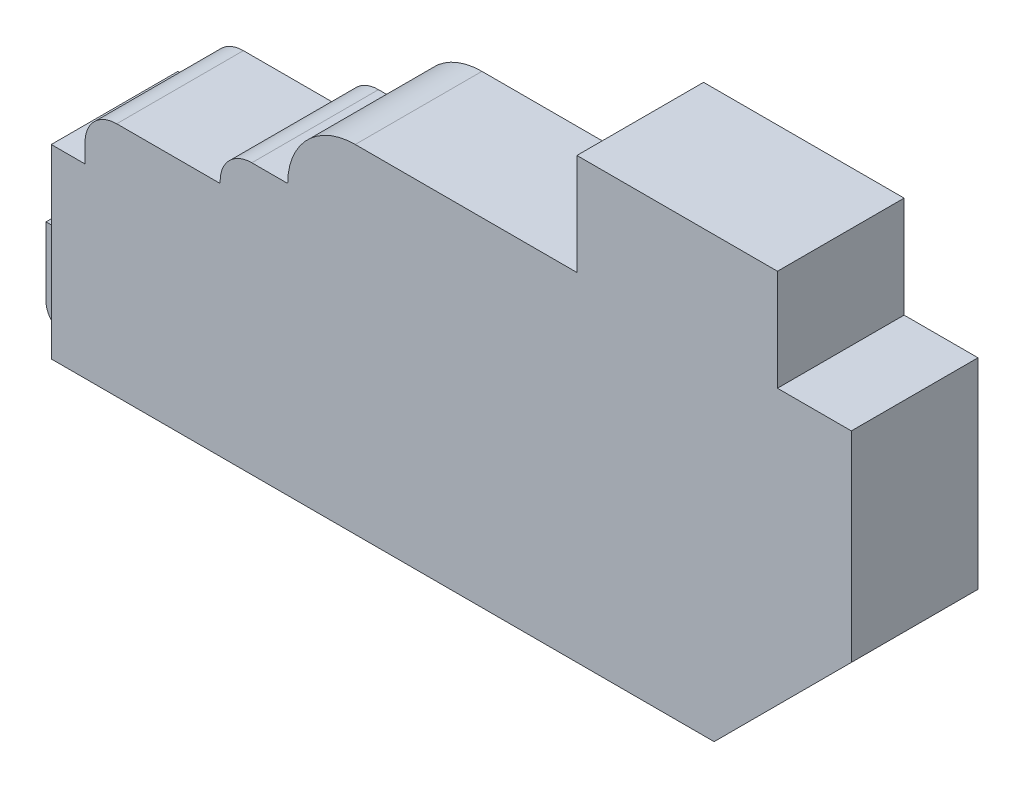
ISO-10303-21;
HEADER;
FILE_DESCRIPTION(('STEP AP214'),'2;1');
FILE_NAME('part.step','',(''),(''),'','','');
FILE_SCHEMA(('AUTOMOTIVE_DESIGN { 1 0 10303 214 1 1 1 1 }'));
ENDSEC;
DATA;
#1=APPLICATION_CONTEXT('core data for automotive mechanical design processes');
#2=APPLICATION_PROTOCOL_DEFINITION('international standard','automotive_design',2000,#1);
#3=PRODUCT_CONTEXT('',#1,'mechanical');
#4=PRODUCT('Part','Part','',(#3));
#5=PRODUCT_RELATED_PRODUCT_CATEGORY('part','',(#4));
#6=PRODUCT_DEFINITION_FORMATION('','',#4);
#7=PRODUCT_DEFINITION_CONTEXT('part definition',#1,'design');
#8=PRODUCT_DEFINITION('design','',#6,#7);
#9=PRODUCT_DEFINITION_SHAPE('','',#8);
#10=(LENGTH_UNIT() NAMED_UNIT(*) SI_UNIT(.MILLI.,.METRE.));
#11=(NAMED_UNIT(*) PLANE_ANGLE_UNIT() SI_UNIT($,.RADIAN.));
#12=(NAMED_UNIT(*) SI_UNIT($,.STERADIAN.) SOLID_ANGLE_UNIT());
#13=UNCERTAINTY_MEASURE_WITH_UNIT(LENGTH_MEASURE(1.E-05),#10,'distance_accuracy_value','');
#14=(GEOMETRIC_REPRESENTATION_CONTEXT(3) GLOBAL_UNCERTAINTY_ASSIGNED_CONTEXT((#13)) GLOBAL_UNIT_ASSIGNED_CONTEXT((#10,
#11,#12)) REPRESENTATION_CONTEXT('',''));
#15=CARTESIAN_POINT('',(0.,0.,0.));
#16=DIRECTION('',(0.,0.,1.));
#17=DIRECTION('',(1.,0.,0.));
#18=AXIS2_PLACEMENT_3D('',#15,#16,#17);
#19=CARTESIAN_POINT('',(-4.7625,13.49375,9.525));
#20=DIRECTION('',(0.,-1.,0.));
#21=DIRECTION('',(0.,0.,-1.));
#22=AXIS2_PLACEMENT_3D('',#19,#20,#21);
#23=PLANE('',#22);
#24=DIRECTION('',(0.,0.,-1.));
#25=VECTOR('',#24,1.);
#26=CARTESIAN_POINT('',(-4.7625,13.49375,9.525));
#27=LINE('',#26,#25);
#28=CARTESIAN_POINT('',(-4.7625,13.49375,5.55625));
#29=VERTEX_POINT('',#28);
#30=CARTESIAN_POINT('',(-4.7625,13.49375,-5.55625));
#31=VERTEX_POINT('',#30);
#32=EDGE_CURVE('E11',#29,#31,#27,.T.);
#33=ORIENTED_EDGE('',*,*,#32,.F.);
#34=DIRECTION('',(1.,0.,0.));
#35=VECTOR('',#34,1.);
#36=CARTESIAN_POINT('',(-4.7625,13.49375,5.55625));
#37=LINE('',#36,#35);
#38=CARTESIAN_POINT('',(0.,13.49375,5.55625));
#39=VERTEX_POINT('',#38);
#40=EDGE_CURVE('E533',#29,#39,#37,.T.);
#41=ORIENTED_EDGE('',*,*,#40,.T.);
#42=DIRECTION('',(0.,0.,-1.));
#43=VECTOR('',#42,1.);
#44=CARTESIAN_POINT('',(0.,13.49375,9.525));
#45=LINE('',#44,#43);
#46=CARTESIAN_POINT('',(0.,13.49375,-5.55625));
#47=VERTEX_POINT('',#46);
#48=EDGE_CURVE('E513',#39,#47,#45,.T.);
#49=ORIENTED_EDGE('',*,*,#48,.T.);
#50=DIRECTION('',(-1.,0.,0.));
#51=VECTOR('',#50,1.);
#52=CARTESIAN_POINT('',(-4.7625,13.49375,-5.55625));
#53=LINE('',#52,#51);
#54=EDGE_CURVE('E549',#47,#31,#53,.T.);
#55=ORIENTED_EDGE('',*,*,#54,.T.);
#56=EDGE_LOOP('',(#33,#41,#49,#55));
#57=FACE_BOUND('',#56,.T.);
#58=ADVANCED_FACE('F360',(#57),#23,.F.);
#59=CARTESIAN_POINT('',(-4.7625,3.17500000000002,9.525));
#60=DIRECTION('',(1.,0.,0.));
#61=DIRECTION('',(0.,0.,-1.));
#62=AXIS2_PLACEMENT_3D('',#59,#60,#61);
#63=PLANE('',#62);
#64=DIRECTION('',(0.,0.,-1.));
#65=VECTOR('',#64,1.);
#66=CARTESIAN_POINT('',(-4.7625,3.17500000000002,9.525));
#67=LINE('',#66,#65);
#68=CARTESIAN_POINT('',(-4.7625,3.175,5.55625));
#69=VERTEX_POINT('',#68);
#70=CARTESIAN_POINT('',(-4.7625,3.175,-5.55625));
#71=VERTEX_POINT('',#70);
#72=EDGE_CURVE('E367',#69,#71,#67,.T.);
#73=ORIENTED_EDGE('',*,*,#72,.F.);
#74=DIRECTION('',(0.,-1.,0.));
#75=VECTOR('',#74,1.);
#76=CARTESIAN_POINT('',(-4.7625,16.03375,5.55625));
#77=LINE('',#76,#75);
#78=EDGE_CURVE('E528',#29,#69,#77,.T.);
#79=ORIENTED_EDGE('',*,*,#78,.F.);
#80=ORIENTED_EDGE('',*,*,#32,.T.);
#81=DIRECTION('',(0.,1.,0.));
#82=VECTOR('',#81,1.);
#83=CARTESIAN_POINT('',(-4.7625,16.03375,-5.55625));
#84=LINE('',#83,#82);
#85=EDGE_CURVE('E535',#71,#31,#84,.T.);
#86=ORIENTED_EDGE('',*,*,#85,.F.);
#87=EDGE_LOOP('',(#73,#79,#80,#86));
#88=FACE_BOUND('',#87,.T.);
#89=ADVANCED_FACE('F684',(#88),#63,.F.);
#90=CARTESIAN_POINT('',(-1.5875,3.175,9.525));
#91=DIRECTION('',(0.,0.,-1.));
#92=DIRECTION('',(-1.,0.,0.));
#93=AXIS2_PLACEMENT_3D('',#90,#91,#92);
#94=CYLINDRICAL_SURFACE('',#93,3.175);
#95=DIRECTION('',(0.,0.,-1.));
#96=VECTOR('',#95,1.);
#97=CARTESIAN_POINT('',(-1.58749999999998,0.,9.525));
#98=LINE('',#97,#96);
#99=CARTESIAN_POINT('',(-1.58749999999998,0.,5.55625));
#100=VERTEX_POINT('',#99);
#101=CARTESIAN_POINT('',(-1.58749999999998,0.,-5.55625));
#102=VERTEX_POINT('',#101);
#103=EDGE_CURVE('E672',#100,#102,#98,.T.);
#104=ORIENTED_EDGE('',*,*,#103,.F.);
#105=CARTESIAN_POINT('',(-1.5875,3.175,5.55625));
#106=DIRECTION('',(0.,0.,-1.));
#107=DIRECTION('',(-1.,0.,0.));
#108=AXIS2_PLACEMENT_3D('',#105,#106,#107);
#109=CIRCLE('',#108,3.175);
#110=EDGE_CURVE('E521',#100,#69,#109,.T.);
#111=ORIENTED_EDGE('',*,*,#110,.T.);
#112=ORIENTED_EDGE('',*,*,#72,.T.);
#113=CARTESIAN_POINT('',(-1.5875,3.175,-5.55625));
#114=DIRECTION('',(0.,0.,1.));
#115=DIRECTION('',(1.,0.,0.));
#116=AXIS2_PLACEMENT_3D('',#113,#114,#115);
#117=CIRCLE('',#116,3.175);
#118=EDGE_CURVE('E546',#71,#102,#117,.T.);
#119=ORIENTED_EDGE('',*,*,#118,.T.);
#120=EDGE_LOOP('',(#104,#111,#112,#119));
#121=FACE_BOUND('',#120,.T.);
#122=ADVANCED_FACE('F676',(#121),#94,.T.);
#123=CARTESIAN_POINT('',(-1.58749999999998,0.,9.525));
#124=DIRECTION('',(0.,1.,0.));
#125=DIRECTION('',(-1.,0.,0.));
#126=AXIS2_PLACEMENT_3D('',#123,#124,#125);
#127=PLANE('',#126);
#128=DIRECTION('',(1.,0.,0.));
#129=VECTOR('',#128,1.);
#130=CARTESIAN_POINT('',(-1.58749999999998,0.,9.525));
#131=LINE('',#130,#129);
#132=CARTESIAN_POINT('',(0.,0.,9.525));
#133=VERTEX_POINT('',#132);
#134=CARTESIAN_POINT('',(99.6949999999999,0.,9.525));
#135=VERTEX_POINT('',#134);
#136=EDGE_CURVE('E527',#133,#135,#131,.T.);
#137=ORIENTED_EDGE('',*,*,#136,.F.);
#138=DIRECTION('',(0.,0.,1.));
#139=VECTOR('',#138,1.);
#140=CARTESIAN_POINT('',(0.,0.,5.55625));
#141=LINE('',#140,#139);
#142=CARTESIAN_POINT('',(0.,0.,5.55625));
#143=VERTEX_POINT('',#142);
#144=EDGE_CURVE('E510',#143,#133,#141,.T.);
#145=ORIENTED_EDGE('',*,*,#144,.F.);
#146=DIRECTION('',(-1.,0.,0.));
#147=VECTOR('',#146,1.);
#148=CARTESIAN_POINT('',(20.3924246428055,0.,5.55625));
#149=LINE('',#148,#147);
#150=EDGE_CURVE('E516',#143,#100,#149,.T.);
#151=ORIENTED_EDGE('',*,*,#150,.T.);
#152=ORIENTED_EDGE('',*,*,#103,.T.);
#153=DIRECTION('',(-1.,0.,0.));
#154=VECTOR('',#153,1.);
#155=CARTESIAN_POINT('',(20.3924246428055,0.,-5.55625));
#156=LINE('',#155,#154);
#157=CARTESIAN_POINT('',(0.,0.,-5.55625));
#158=VERTEX_POINT('',#157);
#159=EDGE_CURVE('E543',#158,#102,#156,.T.);
#160=ORIENTED_EDGE('',*,*,#159,.F.);
#161=DIRECTION('',(0.,0.,1.));
#162=VECTOR('',#161,1.);
#163=CARTESIAN_POINT('',(0.,0.,-5.55625));
#164=LINE('',#163,#162);
#165=CARTESIAN_POINT('',(0.,0.,-9.525));
#166=VERTEX_POINT('',#165);
#167=EDGE_CURVE('E540',#166,#158,#164,.T.);
#168=ORIENTED_EDGE('',*,*,#167,.F.);
#169=DIRECTION('',(1.,0.,0.));
#170=VECTOR('',#169,1.);
#171=CARTESIAN_POINT('',(-1.58749999999998,0.,-9.525));
#172=LINE('',#171,#170);
#173=CARTESIAN_POINT('',(99.6949999999999,0.,-9.525));
#174=VERTEX_POINT('',#173);
#175=EDGE_CURVE('E558',#166,#174,#172,.T.);
#176=ORIENTED_EDGE('',*,*,#175,.T.);
#177=DIRECTION('',(0.,0.,-1.));
#178=VECTOR('',#177,1.);
#179=CARTESIAN_POINT('',(99.6949999999999,0.,9.525));
#180=LINE('',#179,#178);
#181=EDGE_CURVE('E669',#135,#174,#180,.T.);
#182=ORIENTED_EDGE('',*,*,#181,.F.);
#183=EDGE_LOOP('',(#137,#145,#151,#152,#160,#168,#176,#182));
#184=FACE_BOUND('',#183,.T.);
#185=ADVANCED_FACE('F525',(#184),#127,.F.);
#186=CARTESIAN_POINT('',(120.3325,20.6375,9.525));
#187=DIRECTION('',(-0.707106781186546,0.707106781186549,0.));
#188=DIRECTION('',(-0.707106781186549,-0.707106781186546,0.));
#189=AXIS2_PLACEMENT_3D('',#186,#187,#188);
#190=PLANE('',#189);
#191=ORIENTED_EDGE('',*,*,#181,.T.);
#192=DIRECTION('',(0.707106781186549,0.707106781186546,0.));
#193=VECTOR('',#192,1.);
#194=CARTESIAN_POINT('',(120.3325,20.6375,-9.525));
#195=LINE('',#194,#193);
#196=CARTESIAN_POINT('',(120.3325,20.6375,-9.525));
#197=VERTEX_POINT('',#196);
#198=EDGE_CURVE('E560',#174,#197,#195,.T.);
#199=ORIENTED_EDGE('',*,*,#198,.T.);
#200=DIRECTION('',(0.,0.,-1.));
#201=VECTOR('',#200,1.);
#202=CARTESIAN_POINT('',(120.3325,20.6375,9.525));
#203=LINE('',#202,#201);
#204=CARTESIAN_POINT('',(120.3325,20.6375,9.525));
#205=VERTEX_POINT('',#204);
#206=EDGE_CURVE('E667',#205,#197,#203,.T.);
#207=ORIENTED_EDGE('',*,*,#206,.F.);
#208=DIRECTION('',(0.707106781186549,0.707106781186546,0.));
#209=VECTOR('',#208,1.);
#210=CARTESIAN_POINT('',(120.3325,20.6375,9.525));
#211=LINE('',#210,#209);
#212=EDGE_CURVE('E608',#135,#205,#211,.T.);
#213=ORIENTED_EDGE('',*,*,#212,.F.);
#214=EDGE_LOOP('',(#191,#199,#207,#213));
#215=FACE_BOUND('',#214,.T.);
#216=ADVANCED_FACE('F698',(#215),#190,.F.);
#217=CARTESIAN_POINT('',(120.3325,50.8,9.525));
#218=DIRECTION('',(-1.,0.,0.));
#219=DIRECTION('',(0.,0.,1.));
#220=AXIS2_PLACEMENT_3D('',#217,#218,#219);
#221=PLANE('',#220);
#222=ORIENTED_EDGE('',*,*,#206,.T.);
#223=DIRECTION('',(0.,1.,0.));
#224=VECTOR('',#223,1.);
#225=CARTESIAN_POINT('',(120.3325,50.8,-9.525));
#226=LINE('',#225,#224);
#227=CARTESIAN_POINT('',(120.3325,50.8,-9.525));
#228=VERTEX_POINT('',#227);
#229=EDGE_CURVE('E563',#197,#228,#226,.T.);
#230=ORIENTED_EDGE('',*,*,#229,.T.);
#231=DIRECTION('',(0.,0.,-1.));
#232=VECTOR('',#231,1.);
#233=CARTESIAN_POINT('',(120.3325,50.8,9.525));
#234=LINE('',#233,#232);
#235=CARTESIAN_POINT('',(120.3325,50.8,9.525));
#236=VERTEX_POINT('',#235);
#237=EDGE_CURVE('E665',#236,#228,#234,.T.);
#238=ORIENTED_EDGE('',*,*,#237,.F.);
#239=DIRECTION('',(0.,1.,0.));
#240=VECTOR('',#239,1.);
#241=CARTESIAN_POINT('',(120.3325,50.8,9.525));
#242=LINE('',#241,#240);
#243=EDGE_CURVE('E610',#205,#236,#242,.T.);
#244=ORIENTED_EDGE('',*,*,#243,.F.);
#245=EDGE_LOOP('',(#222,#230,#238,#244));
#246=FACE_BOUND('',#245,.T.);
#247=ADVANCED_FACE('F706',(#246),#221,.F.);
#248=CARTESIAN_POINT('',(109.22,50.8,9.525));
#249=DIRECTION('',(0.,-1.,0.));
#250=DIRECTION('',(0.,0.,-1.));
#251=AXIS2_PLACEMENT_3D('',#248,#249,#250);
#252=PLANE('',#251);
#253=ORIENTED_EDGE('',*,*,#237,.T.);
#254=DIRECTION('',(-1.,0.,0.));
#255=VECTOR('',#254,1.);
#256=CARTESIAN_POINT('',(109.22,50.8,-9.525));
#257=LINE('',#256,#255);
#258=CARTESIAN_POINT('',(109.22,50.8,-9.525));
#259=VERTEX_POINT('',#258);
#260=EDGE_CURVE('E566',#228,#259,#257,.T.);
#261=ORIENTED_EDGE('',*,*,#260,.T.);
#262=DIRECTION('',(0.,0.,-1.));
#263=VECTOR('',#262,1.);
#264=CARTESIAN_POINT('',(109.22,50.8,9.525));
#265=LINE('',#264,#263);
#266=CARTESIAN_POINT('',(109.22,50.8,9.525));
#267=VERTEX_POINT('',#266);
#268=EDGE_CURVE('E663',#267,#259,#265,.T.);
#269=ORIENTED_EDGE('',*,*,#268,.F.);
#270=DIRECTION('',(-1.,0.,0.));
#271=VECTOR('',#270,1.);
#272=CARTESIAN_POINT('',(109.22,50.8,9.525));
#273=LINE('',#272,#271);
#274=EDGE_CURVE('E612',#236,#267,#273,.T.);
#275=ORIENTED_EDGE('',*,*,#274,.F.);
#276=EDGE_LOOP('',(#253,#261,#269,#275));
#277=FACE_BOUND('',#276,.T.);
#278=ADVANCED_FACE('F708',(#277),#252,.F.);
#279=CARTESIAN_POINT('',(109.22,66.04,9.525));
#280=DIRECTION('',(-1.,0.,0.));
#281=DIRECTION('',(0.,0.,1.));
#282=AXIS2_PLACEMENT_3D('',#279,#280,#281);
#283=PLANE('',#282);
#284=ORIENTED_EDGE('',*,*,#268,.T.);
#285=DIRECTION('',(0.,1.,0.));
#286=VECTOR('',#285,1.);
#287=CARTESIAN_POINT('',(109.22,66.04,-9.525));
#288=LINE('',#287,#286);
#289=CARTESIAN_POINT('',(109.22,66.04,-9.525));
#290=VERTEX_POINT('',#289);
#291=EDGE_CURVE('E569',#259,#290,#288,.T.);
#292=ORIENTED_EDGE('',*,*,#291,.T.);
#293=DIRECTION('',(0.,0.,-1.));
#294=VECTOR('',#293,1.);
#295=CARTESIAN_POINT('',(109.22,66.04,9.525));
#296=LINE('',#295,#294);
#297=CARTESIAN_POINT('',(109.22,66.04,9.525));
#298=VERTEX_POINT('',#297);
#299=EDGE_CURVE('E661',#298,#290,#296,.T.);
#300=ORIENTED_EDGE('',*,*,#299,.F.);
#301=DIRECTION('',(0.,1.,0.));
#302=VECTOR('',#301,1.);
#303=CARTESIAN_POINT('',(109.22,66.04,9.525));
#304=LINE('',#303,#302);
#305=EDGE_CURVE('E614',#267,#298,#304,.T.);
#306=ORIENTED_EDGE('',*,*,#305,.F.);
#307=EDGE_LOOP('',(#284,#292,#300,#306));
#308=FACE_BOUND('',#307,.T.);
#309=ADVANCED_FACE('F713',(#308),#283,.F.);
#310=CARTESIAN_POINT('',(79.0575,66.04,9.525));
#311=DIRECTION('',(0.,-1.,0.));
#312=DIRECTION('',(0.,0.,-1.));
#313=AXIS2_PLACEMENT_3D('',#310,#311,#312);
#314=PLANE('',#313);
#315=ORIENTED_EDGE('',*,*,#299,.T.);
#316=DIRECTION('',(-1.,0.,0.));
#317=VECTOR('',#316,1.);
#318=CARTESIAN_POINT('',(79.0575,66.04,-9.525));
#319=LINE('',#318,#317);
#320=CARTESIAN_POINT('',(79.0575,66.04,-9.525));
#321=VERTEX_POINT('',#320);
#322=EDGE_CURVE('E572',#290,#321,#319,.T.);
#323=ORIENTED_EDGE('',*,*,#322,.T.);
#324=DIRECTION('',(0.,0.,-1.));
#325=VECTOR('',#324,1.);
#326=CARTESIAN_POINT('',(79.0575,66.04,9.525));
#327=LINE('',#326,#325);
#328=CARTESIAN_POINT('',(79.0575,66.04,9.525));
#329=VERTEX_POINT('',#328);
#330=EDGE_CURVE('E659',#329,#321,#327,.T.);
#331=ORIENTED_EDGE('',*,*,#330,.F.);
#332=DIRECTION('',(-1.,0.,0.));
#333=VECTOR('',#332,1.);
#334=CARTESIAN_POINT('',(79.0575,66.04,9.525));
#335=LINE('',#334,#333);
#336=EDGE_CURVE('E616',#298,#329,#335,.T.);
#337=ORIENTED_EDGE('',*,*,#336,.F.);
#338=EDGE_LOOP('',(#315,#323,#331,#337));
#339=FACE_BOUND('',#338,.T.);
#340=ADVANCED_FACE('F719',(#339),#314,.F.);
#341=CARTESIAN_POINT('',(79.0575,50.8,9.525));
#342=DIRECTION('',(1.,0.,0.));
#343=DIRECTION('',(0.,0.,-1.));
#344=AXIS2_PLACEMENT_3D('',#341,#342,#343);
#345=PLANE('',#344);
#346=ORIENTED_EDGE('',*,*,#330,.T.);
#347=DIRECTION('',(0.,-1.,0.));
#348=VECTOR('',#347,1.);
#349=CARTESIAN_POINT('',(79.0575,50.8,-9.525));
#350=LINE('',#349,#348);
#351=CARTESIAN_POINT('',(79.0575,50.8,-9.525));
#352=VERTEX_POINT('',#351);
#353=EDGE_CURVE('E575',#321,#352,#350,.T.);
#354=ORIENTED_EDGE('',*,*,#353,.T.);
#355=DIRECTION('',(0.,0.,-1.));
#356=VECTOR('',#355,1.);
#357=CARTESIAN_POINT('',(79.0575,50.8,9.525));
#358=LINE('',#357,#356);
#359=CARTESIAN_POINT('',(79.0575,50.8,9.525));
#360=VERTEX_POINT('',#359);
#361=EDGE_CURVE('E657',#360,#352,#358,.T.);
#362=ORIENTED_EDGE('',*,*,#361,.F.);
#363=DIRECTION('',(0.,-1.,0.));
#364=VECTOR('',#363,1.);
#365=CARTESIAN_POINT('',(79.0575,50.8,9.525));
#366=LINE('',#365,#364);
#367=EDGE_CURVE('E618',#329,#360,#366,.T.);
#368=ORIENTED_EDGE('',*,*,#367,.F.);
#369=EDGE_LOOP('',(#346,#354,#362,#368));
#370=FACE_BOUND('',#369,.T.);
#371=ADVANCED_FACE('F723',(#370),#345,.F.);
#372=CARTESIAN_POINT('',(45.72,50.8,9.525));
#373=DIRECTION('',(0.,-1.,0.));
#374=DIRECTION('',(0.,0.,-1.));
#375=AXIS2_PLACEMENT_3D('',#372,#373,#374);
#376=PLANE('',#375);
#377=ORIENTED_EDGE('',*,*,#361,.T.);
#378=DIRECTION('',(-1.,0.,0.));
#379=VECTOR('',#378,1.);
#380=CARTESIAN_POINT('',(45.72,50.8,-9.525));
#381=LINE('',#380,#379);
#382=CARTESIAN_POINT('',(45.72,50.8,-9.525));
#383=VERTEX_POINT('',#382);
#384=EDGE_CURVE('E578',#352,#383,#381,.T.);
#385=ORIENTED_EDGE('',*,*,#384,.T.);
#386=DIRECTION('',(0.,0.,-1.));
#387=VECTOR('',#386,1.);
#388=CARTESIAN_POINT('',(45.72,50.8,9.525));
#389=LINE('',#388,#387);
#390=CARTESIAN_POINT('',(45.72,50.8,9.525));
#391=VERTEX_POINT('',#390);
#392=EDGE_CURVE('E655',#391,#383,#389,.T.);
#393=ORIENTED_EDGE('',*,*,#392,.F.);
#394=DIRECTION('',(-1.,0.,0.));
#395=VECTOR('',#394,1.);
#396=CARTESIAN_POINT('',(45.72,50.8,9.525));
#397=LINE('',#396,#395);
#398=EDGE_CURVE('E620',#360,#391,#397,.T.);
#399=ORIENTED_EDGE('',*,*,#398,.F.);
#400=EDGE_LOOP('',(#377,#385,#393,#399));
#401=FACE_BOUND('',#400,.T.);
#402=ADVANCED_FACE('F728',(#401),#376,.F.);
#403=CARTESIAN_POINT('',(45.72,40.64,9.525));
#404=DIRECTION('',(0.,0.,-1.));
#405=DIRECTION('',(-1.,0.,0.));
#406=AXIS2_PLACEMENT_3D('',#403,#404,#405);
#407=CYLINDRICAL_SURFACE('',#406,10.16);
#408=ORIENTED_EDGE('',*,*,#392,.T.);
#409=CARTESIAN_POINT('',(45.72,40.64,-9.525));
#410=DIRECTION('',(0.,0.,1.));
#411=DIRECTION('',(1.,0.,0.));
#412=AXIS2_PLACEMENT_3D('',#409,#410,#411);
#413=CIRCLE('',#412,10.16);
#414=CARTESIAN_POINT('',(35.56,40.64,-9.525));
#415=VERTEX_POINT('',#414);
#416=EDGE_CURVE('E581',#383,#415,#413,.T.);
#417=ORIENTED_EDGE('',*,*,#416,.T.);
#418=DIRECTION('',(0.,0.,-1.));
#419=VECTOR('',#418,1.);
#420=CARTESIAN_POINT('',(35.56,40.64,9.525));
#421=LINE('',#420,#419);
#422=CARTESIAN_POINT('',(35.56,40.64,9.525));
#423=VERTEX_POINT('',#422);
#424=EDGE_CURVE('E653',#423,#415,#421,.T.);
#425=ORIENTED_EDGE('',*,*,#424,.F.);
#426=CARTESIAN_POINT('',(45.72,40.64,9.525));
#427=DIRECTION('',(0.,0.,1.));
#428=DIRECTION('',(1.,0.,0.));
#429=AXIS2_PLACEMENT_3D('',#426,#427,#428);
#430=CIRCLE('',#429,10.16);
#431=EDGE_CURVE('E622',#391,#423,#430,.T.);
#432=ORIENTED_EDGE('',*,*,#431,.F.);
#433=EDGE_LOOP('',(#408,#417,#425,#432));
#434=FACE_BOUND('',#433,.T.);
#435=ADVANCED_FACE('F734',(#434),#407,.T.);
#436=CARTESIAN_POINT('',(30.1625,40.64,9.525));
#437=DIRECTION('',(0.,-1.,0.));
#438=DIRECTION('',(0.,0.,-1.));
#439=AXIS2_PLACEMENT_3D('',#436,#437,#438);
#440=PLANE('',#439);
#441=ORIENTED_EDGE('',*,*,#424,.T.);
#442=DIRECTION('',(-1.,0.,0.));
#443=VECTOR('',#442,1.);
#444=CARTESIAN_POINT('',(30.1625,40.64,-9.525));
#445=LINE('',#444,#443);
#446=CARTESIAN_POINT('',(30.1625,40.64,-9.525));
#447=VERTEX_POINT('',#446);
#448=EDGE_CURVE('E584',#415,#447,#445,.T.);
#449=ORIENTED_EDGE('',*,*,#448,.T.);
#450=DIRECTION('',(0.,0.,-1.));
#451=VECTOR('',#450,1.);
#452=CARTESIAN_POINT('',(30.1625,40.64,9.525));
#453=LINE('',#452,#451);
#454=CARTESIAN_POINT('',(30.1625,40.64,9.525));
#455=VERTEX_POINT('',#454);
#456=EDGE_CURVE('E651',#455,#447,#453,.T.);
#457=ORIENTED_EDGE('',*,*,#456,.F.);
#458=DIRECTION('',(-1.,0.,0.));
#459=VECTOR('',#458,1.);
#460=CARTESIAN_POINT('',(30.1625,40.64,9.525));
#461=LINE('',#460,#459);
#462=EDGE_CURVE('E624',#423,#455,#461,.T.);
#463=ORIENTED_EDGE('',*,*,#462,.F.);
#464=EDGE_LOOP('',(#441,#449,#457,#463));
#465=FACE_BOUND('',#464,.T.);
#466=ADVANCED_FACE('F738',(#465),#440,.F.);
#467=CARTESIAN_POINT('',(30.1625,35.8775,9.525));
#468=DIRECTION('',(0.,0.,-1.));
#469=DIRECTION('',(-1.,0.,0.));
#470=AXIS2_PLACEMENT_3D('',#467,#468,#469);
#471=CYLINDRICAL_SURFACE('',#470,4.7625);
#472=ORIENTED_EDGE('',*,*,#456,.T.);
#473=CARTESIAN_POINT('',(30.1625,35.8775,-9.525));
#474=DIRECTION('',(0.,0.,1.));
#475=DIRECTION('',(-1.,0.,0.));
#476=AXIS2_PLACEMENT_3D('',#473,#474,#475);
#477=CIRCLE('',#476,4.7625);
#478=CARTESIAN_POINT('',(25.4,35.8775,-9.525));
#479=VERTEX_POINT('',#478);
#480=EDGE_CURVE('E587',#447,#479,#477,.T.);
#481=ORIENTED_EDGE('',*,*,#480,.T.);
#482=DIRECTION('',(0.,0.,-1.));
#483=VECTOR('',#482,1.);
#484=CARTESIAN_POINT('',(25.4,35.8775,9.525));
#485=LINE('',#484,#483);
#486=CARTESIAN_POINT('',(25.4,35.8775,9.525));
#487=VERTEX_POINT('',#486);
#488=EDGE_CURVE('E649',#487,#479,#485,.T.);
#489=ORIENTED_EDGE('',*,*,#488,.F.);
#490=CARTESIAN_POINT('',(30.1625,35.8775,9.525));
#491=DIRECTION('',(0.,0.,1.));
#492=DIRECTION('',(-1.,0.,0.));
#493=AXIS2_PLACEMENT_3D('',#490,#491,#492);
#494=CIRCLE('',#493,4.7625);
#495=EDGE_CURVE('E626',#455,#487,#494,.T.);
#496=ORIENTED_EDGE('',*,*,#495,.F.);
#497=EDGE_LOOP('',(#472,#481,#489,#496));
#498=FACE_BOUND('',#497,.T.);
#499=ADVANCED_FACE('F743',(#498),#471,.T.);
#500=CARTESIAN_POINT('',(25.4,35.56,9.525));
#501=DIRECTION('',(1.,0.,0.));
#502=DIRECTION('',(0.,0.,-1.));
#503=AXIS2_PLACEMENT_3D('',#500,#501,#502);
#504=PLANE('',#503);
#505=ORIENTED_EDGE('',*,*,#488,.T.);
#506=DIRECTION('',(0.,-1.,0.));
#507=VECTOR('',#506,1.);
#508=CARTESIAN_POINT('',(25.4,35.56,-9.525));
#509=LINE('',#508,#507);
#510=CARTESIAN_POINT('',(25.4,35.56,-9.525));
#511=VERTEX_POINT('',#510);
#512=EDGE_CURVE('E590',#479,#511,#509,.T.);
#513=ORIENTED_EDGE('',*,*,#512,.T.);
#514=DIRECTION('',(0.,0.,-1.));
#515=VECTOR('',#514,1.);
#516=CARTESIAN_POINT('',(25.4,35.56,9.525));
#517=LINE('',#516,#515);
#518=CARTESIAN_POINT('',(25.4,35.56,9.525));
#519=VERTEX_POINT('',#518);
#520=EDGE_CURVE('E647',#519,#511,#517,.T.);
#521=ORIENTED_EDGE('',*,*,#520,.F.);
#522=DIRECTION('',(0.,-1.,0.));
#523=VECTOR('',#522,1.);
#524=CARTESIAN_POINT('',(25.4,35.56,9.525));
#525=LINE('',#524,#523);
#526=EDGE_CURVE('E628',#487,#519,#525,.T.);
#527=ORIENTED_EDGE('',*,*,#526,.F.);
#528=EDGE_LOOP('',(#505,#513,#521,#527));
#529=FACE_BOUND('',#528,.T.);
#530=ADVANCED_FACE('F749',(#529),#504,.F.);
#531=CARTESIAN_POINT('',(9.84250000000003,35.56,9.525));
#532=DIRECTION('',(0.,-1.,0.));
#533=DIRECTION('',(0.,0.,-1.));
#534=AXIS2_PLACEMENT_3D('',#531,#532,#533);
#535=PLANE('',#534);
#536=ORIENTED_EDGE('',*,*,#520,.T.);
#537=DIRECTION('',(-1.,0.,0.));
#538=VECTOR('',#537,1.);
#539=CARTESIAN_POINT('',(9.84250000000003,35.56,-9.525));
#540=LINE('',#539,#538);
#541=CARTESIAN_POINT('',(9.84250000000003,35.56,-9.525));
#542=VERTEX_POINT('',#541);
#543=EDGE_CURVE('E593',#511,#542,#540,.T.);
#544=ORIENTED_EDGE('',*,*,#543,.T.);
#545=DIRECTION('',(0.,0.,-1.));
#546=VECTOR('',#545,1.);
#547=CARTESIAN_POINT('',(9.84250000000003,35.56,9.525));
#548=LINE('',#547,#546);
#549=CARTESIAN_POINT('',(9.84250000000003,35.56,9.525));
#550=VERTEX_POINT('',#549);
#551=EDGE_CURVE('E645',#550,#542,#548,.T.);
#552=ORIENTED_EDGE('',*,*,#551,.F.);
#553=DIRECTION('',(-1.,0.,0.));
#554=VECTOR('',#553,1.);
#555=CARTESIAN_POINT('',(9.84250000000003,35.56,9.525));
#556=LINE('',#555,#554);
#557=EDGE_CURVE('E630',#519,#550,#556,.T.);
#558=ORIENTED_EDGE('',*,*,#557,.F.);
#559=EDGE_LOOP('',(#536,#544,#552,#558));
#560=FACE_BOUND('',#559,.T.);
#561=ADVANCED_FACE('F753',(#560),#535,.F.);
#562=CARTESIAN_POINT('',(9.8425,30.7975,9.525));
#563=DIRECTION('',(0.,0.,-1.));
#564=DIRECTION('',(-1.,0.,0.));
#565=AXIS2_PLACEMENT_3D('',#562,#563,#564);
#566=CYLINDRICAL_SURFACE('',#565,4.7625);
#567=ORIENTED_EDGE('',*,*,#551,.T.);
#568=CARTESIAN_POINT('',(9.8425,30.7975,-9.525));
#569=DIRECTION('',(0.,0.,1.));
#570=DIRECTION('',(-1.,0.,0.));
#571=AXIS2_PLACEMENT_3D('',#568,#569,#570);
#572=CIRCLE('',#571,4.7625);
#573=CARTESIAN_POINT('',(5.08,30.7975,-9.525));
#574=VERTEX_POINT('',#573);
#575=EDGE_CURVE('E596',#542,#574,#572,.T.);
#576=ORIENTED_EDGE('',*,*,#575,.T.);
#577=DIRECTION('',(0.,0.,-1.));
#578=VECTOR('',#577,1.);
#579=CARTESIAN_POINT('',(5.08,30.7975,9.525));
#580=LINE('',#579,#578);
#581=CARTESIAN_POINT('',(5.08,30.7975,9.525));
#582=VERTEX_POINT('',#581);
#583=EDGE_CURVE('E643',#582,#574,#580,.T.);
#584=ORIENTED_EDGE('',*,*,#583,.F.);
#585=CARTESIAN_POINT('',(9.8425,30.7975,9.525));
#586=DIRECTION('',(0.,0.,1.));
#587=DIRECTION('',(-1.,0.,0.));
#588=AXIS2_PLACEMENT_3D('',#585,#586,#587);
#589=CIRCLE('',#588,4.7625);
#590=EDGE_CURVE('E632',#550,#582,#589,.T.);
#591=ORIENTED_EDGE('',*,*,#590,.F.);
#592=EDGE_LOOP('',(#567,#576,#584,#591));
#593=FACE_BOUND('',#592,.T.);
#594=ADVANCED_FACE('F758',(#593),#566,.T.);
#595=CARTESIAN_POINT('',(5.08,27.94,9.525));
#596=DIRECTION('',(1.,0.,0.));
#597=DIRECTION('',(0.,0.,-1.));
#598=AXIS2_PLACEMENT_3D('',#595,#596,#597);
#599=PLANE('',#598);
#600=ORIENTED_EDGE('',*,*,#583,.T.);
#601=DIRECTION('',(0.,-1.,0.));
#602=VECTOR('',#601,1.);
#603=CARTESIAN_POINT('',(5.08,27.94,-9.525));
#604=LINE('',#603,#602);
#605=CARTESIAN_POINT('',(5.08,27.94,-9.525));
#606=VERTEX_POINT('',#605);
#607=EDGE_CURVE('E599',#574,#606,#604,.T.);
#608=ORIENTED_EDGE('',*,*,#607,.T.);
#609=DIRECTION('',(0.,0.,-1.));
#610=VECTOR('',#609,1.);
#611=CARTESIAN_POINT('',(5.08,27.94,9.525));
#612=LINE('',#611,#610);
#613=CARTESIAN_POINT('',(5.08,27.94,9.525));
#614=VERTEX_POINT('',#613);
#615=EDGE_CURVE('E641',#614,#606,#612,.T.);
#616=ORIENTED_EDGE('',*,*,#615,.F.);
#617=DIRECTION('',(0.,-1.,0.));
#618=VECTOR('',#617,1.);
#619=CARTESIAN_POINT('',(5.08,27.94,9.525));
#620=LINE('',#619,#618);
#621=EDGE_CURVE('E634',#582,#614,#620,.T.);
#622=ORIENTED_EDGE('',*,*,#621,.F.);
#623=EDGE_LOOP('',(#600,#608,#616,#622));
#624=FACE_BOUND('',#623,.T.);
#625=ADVANCED_FACE('F762',(#624),#599,.F.);
#626=CARTESIAN_POINT('',(0.,27.94,9.525));
#627=DIRECTION('',(0.,-1.,0.));
#628=DIRECTION('',(0.,0.,-1.));
#629=AXIS2_PLACEMENT_3D('',#626,#627,#628);
#630=PLANE('',#629);
#631=ORIENTED_EDGE('',*,*,#615,.T.);
#632=DIRECTION('',(-1.,0.,0.));
#633=VECTOR('',#632,1.);
#634=CARTESIAN_POINT('',(0.,27.94,-9.525));
#635=LINE('',#634,#633);
#636=CARTESIAN_POINT('',(0.,27.94,-9.525));
#637=VERTEX_POINT('',#636);
#638=EDGE_CURVE('E602',#606,#637,#635,.T.);
#639=ORIENTED_EDGE('',*,*,#638,.T.);
#640=DIRECTION('',(0.,0.,-1.));
#641=VECTOR('',#640,1.);
#642=CARTESIAN_POINT('',(0.,27.94,9.525));
#643=LINE('',#642,#641);
#644=CARTESIAN_POINT('',(0.,27.94,9.525));
#645=VERTEX_POINT('',#644);
#646=EDGE_CURVE('E639',#645,#637,#643,.T.);
#647=ORIENTED_EDGE('',*,*,#646,.F.);
#648=DIRECTION('',(-1.,0.,0.));
#649=VECTOR('',#648,1.);
#650=CARTESIAN_POINT('',(0.,27.94,9.525));
#651=LINE('',#650,#649);
#652=EDGE_CURVE('E379',#614,#645,#651,.T.);
#653=ORIENTED_EDGE('',*,*,#652,.F.);
#654=EDGE_LOOP('',(#631,#639,#647,#653));
#655=FACE_BOUND('',#654,.T.);
#656=ADVANCED_FACE('F765',(#655),#630,.F.);
#657=CARTESIAN_POINT('',(0.,13.49375,9.525));
#658=DIRECTION('',(1.,0.,0.));
#659=DIRECTION('',(0.,0.,-1.));
#660=AXIS2_PLACEMENT_3D('',#657,#658,#659);
#661=PLANE('',#660);
#662=ORIENTED_EDGE('',*,*,#144,.T.);
#663=DIRECTION('',(0.,-1.,0.));
#664=VECTOR('',#663,1.);
#665=CARTESIAN_POINT('',(0.,13.49375,9.525));
#666=LINE('',#665,#664);
#667=EDGE_CURVE('E374',#645,#133,#666,.T.);
#668=ORIENTED_EDGE('',*,*,#667,.F.);
#669=ORIENTED_EDGE('',*,*,#646,.T.);
#670=DIRECTION('',(0.,-1.,0.));
#671=VECTOR('',#670,1.);
#672=CARTESIAN_POINT('',(0.,13.49375,-9.525));
#673=LINE('',#672,#671);
#674=EDGE_CURVE('E605',#637,#166,#673,.T.);
#675=ORIENTED_EDGE('',*,*,#674,.T.);
#676=ORIENTED_EDGE('',*,*,#167,.T.);
#677=DIRECTION('',(0.,1.,0.));
#678=VECTOR('',#677,1.);
#679=CARTESIAN_POINT('',(0.,16.03375,-5.55625));
#680=LINE('',#679,#678);
#681=EDGE_CURVE('E538',#158,#47,#680,.T.);
#682=ORIENTED_EDGE('',*,*,#681,.T.);
#683=ORIENTED_EDGE('',*,*,#48,.F.);
#684=DIRECTION('',(0.,-1.,0.));
#685=VECTOR('',#684,1.);
#686=CARTESIAN_POINT('',(0.,16.03375,5.55625));
#687=LINE('',#686,#685);
#688=EDGE_CURVE('E505',#39,#143,#687,.T.);
#689=ORIENTED_EDGE('',*,*,#688,.T.);
#690=EDGE_LOOP('',(#662,#668,#669,#675,#676,#682,#683,#689));
#691=FACE_BOUND('',#690,.T.);
#692=CARTESIAN_POINT('',(0.,20.6502,0.));
#693=DIRECTION('',(-1.,0.,0.));
#694=DIRECTION('',(0.,0.,1.));
#695=AXIS2_PLACEMENT_3D('',#692,#693,#694);
#696=CIRCLE('',#695,3.5687);
#697=CARTESIAN_POINT('',(0.,20.6502,3.5687));
#698=VERTEX_POINT('',#697);
#699=EDGE_CURVE('E552',#698,#698,#696,.T.);
#700=ORIENTED_EDGE('',*,*,#699,.F.);
#701=EDGE_LOOP('',(#700));
#702=FACE_BOUND('',#701,.T.);
#703=ADVANCED_FACE('F507',(#691,#702),#661,.F.);
#704=CARTESIAN_POINT('',(9.8425,30.7975,9.525));
#705=DIRECTION('',(0.,0.,-1.));
#706=DIRECTION('',(-1.,0.,0.));
#707=AXIS2_PLACEMENT_3D('',#704,#705,#706);
#708=PLANE('',#707);
#709=ORIENTED_EDGE('',*,*,#667,.T.);
#710=ORIENTED_EDGE('',*,*,#136,.T.);
#711=ORIENTED_EDGE('',*,*,#212,.T.);
#712=ORIENTED_EDGE('',*,*,#243,.T.);
#713=ORIENTED_EDGE('',*,*,#274,.T.);
#714=ORIENTED_EDGE('',*,*,#305,.T.);
#715=ORIENTED_EDGE('',*,*,#336,.T.);
#716=ORIENTED_EDGE('',*,*,#367,.T.);
#717=ORIENTED_EDGE('',*,*,#398,.T.);
#718=ORIENTED_EDGE('',*,*,#431,.T.);
#719=ORIENTED_EDGE('',*,*,#462,.T.);
#720=ORIENTED_EDGE('',*,*,#495,.T.);
#721=ORIENTED_EDGE('',*,*,#526,.T.);
#722=ORIENTED_EDGE('',*,*,#557,.T.);
#723=ORIENTED_EDGE('',*,*,#590,.T.);
#724=ORIENTED_EDGE('',*,*,#621,.T.);
#725=ORIENTED_EDGE('',*,*,#652,.T.);
#726=EDGE_LOOP('',(#709,#710,#711,#712,#713,#714,#715,#716,#717,#718,#719,#720,#721,#722,#723,
#724,#725));
#727=FACE_BOUND('',#726,.T.);
#728=ADVANCED_FACE('F701',(#727),#708,.F.);
#729=CARTESIAN_POINT('',(9.8425,30.7975,-9.525));
#730=DIRECTION('',(0.,0.,-1.));
#731=DIRECTION('',(-1.,0.,0.));
#732=AXIS2_PLACEMENT_3D('',#729,#730,#731);
#733=PLANE('',#732);
#734=ORIENTED_EDGE('',*,*,#175,.F.);
#735=ORIENTED_EDGE('',*,*,#674,.F.);
#736=ORIENTED_EDGE('',*,*,#638,.F.);
#737=ORIENTED_EDGE('',*,*,#607,.F.);
#738=ORIENTED_EDGE('',*,*,#575,.F.);
#739=ORIENTED_EDGE('',*,*,#543,.F.);
#740=ORIENTED_EDGE('',*,*,#512,.F.);
#741=ORIENTED_EDGE('',*,*,#480,.F.);
#742=ORIENTED_EDGE('',*,*,#448,.F.);
#743=ORIENTED_EDGE('',*,*,#416,.F.);
#744=ORIENTED_EDGE('',*,*,#384,.F.);
#745=ORIENTED_EDGE('',*,*,#353,.F.);
#746=ORIENTED_EDGE('',*,*,#322,.F.);
#747=ORIENTED_EDGE('',*,*,#291,.F.);
#748=ORIENTED_EDGE('',*,*,#260,.F.);
#749=ORIENTED_EDGE('',*,*,#229,.F.);
#750=ORIENTED_EDGE('',*,*,#198,.F.);
#751=EDGE_LOOP('',(#734,#735,#736,#737,#738,#739,#740,#741,#742,#743,#744,#745,#746,#747,#748,
#749,#750));
#752=FACE_BOUND('',#751,.T.);
#753=ADVANCED_FACE('F692',(#752),#733,.T.);
#754=CARTESIAN_POINT('',(12.7,20.6502,0.));
#755=DIRECTION('',(-1.,0.,0.));
#756=DIRECTION('',(0.,0.,1.));
#757=AXIS2_PLACEMENT_3D('',#754,#755,#756);
#758=CYLINDRICAL_SURFACE('',#757,3.5687);
#759=CARTESIAN_POINT('',(12.7,20.6502,0.));
#760=DIRECTION('',(-1.,0.,0.));
#761=DIRECTION('',(0.,0.,1.));
#762=AXIS2_PLACEMENT_3D('',#759,#760,#761);
#763=CIRCLE('',#762,3.5687);
#764=CARTESIAN_POINT('',(12.7,20.6502,3.5687));
#765=VERTEX_POINT('',#764);
#766=EDGE_CURVE('E555',#765,#765,#763,.T.);
#767=ORIENTED_EDGE('',*,*,#766,.F.);
#768=EDGE_LOOP('',(#767));
#769=FACE_BOUND('',#768,.T.);
#770=ORIENTED_EDGE('',*,*,#699,.T.);
#771=EDGE_LOOP('',(#770));
#772=FACE_BOUND('',#771,.T.);
#773=ADVANCED_FACE('F830',(#769,#772),#758,.F.);
#774=CARTESIAN_POINT('',(12.7,20.6502,0.));
#775=DIRECTION('',(-1.,0.,0.));
#776=DIRECTION('',(0.,0.,1.));
#777=AXIS2_PLACEMENT_3D('',#774,#775,#776);
#778=PLANE('',#777);
#779=ORIENTED_EDGE('',*,*,#766,.T.);
#780=EDGE_LOOP('',(#779));
#781=FACE_BOUND('',#780,.T.);
#782=ADVANCED_FACE('F839',(#781),#778,.T.);
#783=CARTESIAN_POINT('',(20.3924246428055,16.03375,-5.55625));
#784=DIRECTION('',(0.,0.,1.));
#785=DIRECTION('',(1.,0.,0.));
#786=AXIS2_PLACEMENT_3D('',#783,#784,#785);
#787=PLANE('',#786);
#788=ORIENTED_EDGE('',*,*,#681,.F.);
#789=ORIENTED_EDGE('',*,*,#159,.T.);
#790=ORIENTED_EDGE('',*,*,#118,.F.);
#791=ORIENTED_EDGE('',*,*,#85,.T.);
#792=ORIENTED_EDGE('',*,*,#54,.F.);
#793=EDGE_LOOP('',(#788,#789,#790,#791,#792));
#794=FACE_BOUND('',#793,.T.);
#795=ADVANCED_FACE('F681',(#794),#787,.F.);
#796=CARTESIAN_POINT('',(20.3924246428055,16.03375,5.55625));
#797=DIRECTION('',(0.,0.,-1.));
#798=DIRECTION('',(-1.,0.,0.));
#799=AXIS2_PLACEMENT_3D('',#796,#797,#798);
#800=PLANE('',#799);
#801=ORIENTED_EDGE('',*,*,#78,.T.);
#802=ORIENTED_EDGE('',*,*,#110,.F.);
#803=ORIENTED_EDGE('',*,*,#150,.F.);
#804=ORIENTED_EDGE('',*,*,#688,.F.);
#805=ORIENTED_EDGE('',*,*,#40,.F.);
#806=EDGE_LOOP('',(#801,#802,#803,#804,#805));
#807=FACE_BOUND('',#806,.T.);
#808=ADVANCED_FACE('F519',(#807),#800,.F.);
#809=CLOSED_SHELL('',(#58,#89,#122,#185,#216,#247,#278,#309,#340,#371,#402,#435,#466,#499,#530,
#561,#594,#625,#656,#703,#728,#753,#773,#782,#795,#808));
#810=MANIFOLD_SOLID_BREP('B2',#809);
#811=ADVANCED_BREP_SHAPE_REPRESENTATION('',(#18,#810),#14);
#812=SHAPE_DEFINITION_REPRESENTATION(#9,#811);
ENDSEC;
END-ISO-10303-21;
